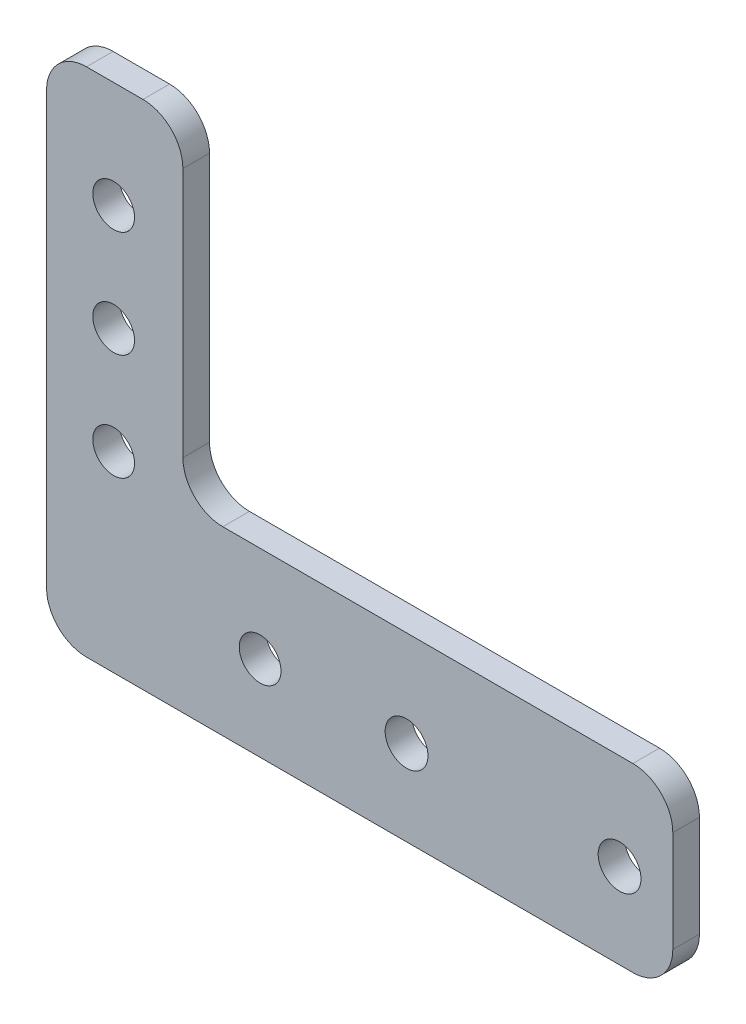
ISO-10303-21;
HEADER;
FILE_DESCRIPTION(('STEP AP214'),'2;1');
FILE_NAME('part.step','',(''),(''),'','','');
FILE_SCHEMA(('AUTOMOTIVE_DESIGN { 1 0 10303 214 1 1 1 1 }'));
ENDSEC;
DATA;
#1=APPLICATION_CONTEXT('core data for automotive mechanical design processes');
#2=APPLICATION_PROTOCOL_DEFINITION('international standard','automotive_design',2000,#1);
#3=PRODUCT_CONTEXT('',#1,'mechanical');
#4=PRODUCT('Part','Part','',(#3));
#5=PRODUCT_RELATED_PRODUCT_CATEGORY('part','',(#4));
#6=PRODUCT_DEFINITION_FORMATION('','',#4);
#7=PRODUCT_DEFINITION_CONTEXT('part definition',#1,'design');
#8=PRODUCT_DEFINITION('design','',#6,#7);
#9=PRODUCT_DEFINITION_SHAPE('','',#8);
#10=(LENGTH_UNIT() NAMED_UNIT(*) SI_UNIT(.MILLI.,.METRE.));
#11=(NAMED_UNIT(*) PLANE_ANGLE_UNIT() SI_UNIT($,.RADIAN.));
#12=(NAMED_UNIT(*) SI_UNIT($,.STERADIAN.) SOLID_ANGLE_UNIT());
#13=UNCERTAINTY_MEASURE_WITH_UNIT(LENGTH_MEASURE(1.E-05),#10,'distance_accuracy_value','');
#14=(GEOMETRIC_REPRESENTATION_CONTEXT(3) GLOBAL_UNCERTAINTY_ASSIGNED_CONTEXT((#13)) GLOBAL_UNIT_ASSIGNED_CONTEXT((#10,
#11,#12)) REPRESENTATION_CONTEXT('',''));
#15=CARTESIAN_POINT('',(0.,0.,0.));
#16=DIRECTION('',(0.,0.,1.));
#17=DIRECTION('',(1.,0.,0.));
#18=AXIS2_PLACEMENT_3D('',#15,#16,#17);
#19=CARTESIAN_POINT('',(-33.401,0.,3.175));
#20=DIRECTION('',(-1.,0.,0.));
#21=DIRECTION('',(0.,0.,1.));
#22=AXIS2_PLACEMENT_3D('',#19,#20,#21);
#23=PLANE('',#22);
#24=DIRECTION('',(0.,1.,0.));
#25=VECTOR('',#24,1.);
#26=CARTESIAN_POINT('',(-33.401,0.,3.175));
#27=LINE('',#26,#25);
#28=CARTESIAN_POINT('',(-33.401,-24.4475,3.175));
#29=VERTEX_POINT('',#28);
#30=CARTESIAN_POINT('',(-33.401,26.9875,3.175));
#31=VERTEX_POINT('',#30);
#32=EDGE_CURVE('E311',#29,#31,#27,.T.);
#33=ORIENTED_EDGE('',*,*,#32,.T.);
#34=DIRECTION('',(0.,0.,-1.));
#35=VECTOR('',#34,1.);
#36=CARTESIAN_POINT('',(-33.401,26.9875,3.175));
#37=LINE('',#36,#35);
#38=CARTESIAN_POINT('',(-33.401,26.9875,0.));
#39=VERTEX_POINT('',#38);
#40=EDGE_CURVE('E143',#31,#39,#37,.T.);
#41=ORIENTED_EDGE('',*,*,#40,.T.);
#42=DIRECTION('',(0.,1.,0.));
#43=VECTOR('',#42,1.);
#44=CARTESIAN_POINT('',(-33.401,0.,0.));
#45=LINE('',#44,#43);
#46=CARTESIAN_POINT('',(-33.401,-24.4475,0.));
#47=VERTEX_POINT('',#46);
#48=EDGE_CURVE('E134',#47,#39,#45,.T.);
#49=ORIENTED_EDGE('',*,*,#48,.F.);
#50=DIRECTION('',(0.,0.,-1.));
#51=VECTOR('',#50,1.);
#52=CARTESIAN_POINT('',(-33.401,-24.4475,3.175));
#53=LINE('',#52,#51);
#54=EDGE_CURVE('E148',#47,#29,#53,.F.);
#55=ORIENTED_EDGE('',*,*,#54,.T.);
#56=EDGE_LOOP('',(#33,#41,#49,#55));
#57=FACE_BOUND('',#56,.T.);
#58=ADVANCED_FACE('F41',(#57),#23,.T.);
#59=CARTESIAN_POINT('',(0.,-29.21,3.175));
#60=DIRECTION('',(0.,1.,0.));
#61=DIRECTION('',(0.,0.,1.));
#62=AXIS2_PLACEMENT_3D('',#59,#60,#61);
#63=PLANE('',#62);
#64=DIRECTION('',(1.,0.,0.));
#65=VECTOR('',#64,1.);
#66=CARTESIAN_POINT('',(0.,-29.21,0.));
#67=LINE('',#66,#65);
#68=CARTESIAN_POINT('',(-28.6385,-29.21,0.));
#69=VERTEX_POINT('',#68);
#70=CARTESIAN_POINT('',(36.5125,-29.21,0.));
#71=VERTEX_POINT('',#70);
#72=EDGE_CURVE('E136',#69,#71,#67,.T.);
#73=ORIENTED_EDGE('',*,*,#72,.T.);
#74=DIRECTION('',(0.,0.,-1.));
#75=VECTOR('',#74,1.);
#76=CARTESIAN_POINT('',(36.5125,-29.21,3.175));
#77=LINE('',#76,#75);
#78=CARTESIAN_POINT('',(36.5125,-29.21,3.175));
#79=VERTEX_POINT('',#78);
#80=EDGE_CURVE('E224',#71,#79,#77,.F.);
#81=ORIENTED_EDGE('',*,*,#80,.T.);
#82=DIRECTION('',(1.,0.,0.));
#83=VECTOR('',#82,1.);
#84=CARTESIAN_POINT('',(0.,-29.21,3.175));
#85=LINE('',#84,#83);
#86=CARTESIAN_POINT('',(-28.6385,-29.21,3.175));
#87=VERTEX_POINT('',#86);
#88=EDGE_CURVE('E314',#87,#79,#85,.T.);
#89=ORIENTED_EDGE('',*,*,#88,.F.);
#90=DIRECTION('',(0.,0.,-1.));
#91=VECTOR('',#90,1.);
#92=CARTESIAN_POINT('',(-28.6385,-29.21,0.));
#93=LINE('',#92,#91);
#94=EDGE_CURVE('E221',#87,#69,#93,.T.);
#95=ORIENTED_EDGE('',*,*,#94,.T.);
#96=EDGE_LOOP('',(#73,#81,#89,#95));
#97=FACE_BOUND('',#96,.T.);
#98=ADVANCED_FACE('F335',(#97),#63,.F.);
#99=CARTESIAN_POINT('',(41.275,0.,3.175));
#100=DIRECTION('',(-1.,0.,0.));
#101=DIRECTION('',(0.,0.,1.));
#102=AXIS2_PLACEMENT_3D('',#99,#100,#101);
#103=PLANE('',#102);
#104=DIRECTION('',(0.,1.,0.));
#105=VECTOR('',#104,1.);
#106=CARTESIAN_POINT('',(41.275,0.,0.));
#107=LINE('',#106,#105);
#108=CARTESIAN_POINT('',(41.275,-24.4475,0.));
#109=VERTEX_POINT('',#108);
#110=CARTESIAN_POINT('',(41.275,-12.3825,0.));
#111=VERTEX_POINT('',#110);
#112=EDGE_CURVE('E240',#109,#111,#107,.T.);
#113=ORIENTED_EDGE('',*,*,#112,.T.);
#114=DIRECTION('',(0.,0.,-1.));
#115=VECTOR('',#114,1.);
#116=CARTESIAN_POINT('',(41.275,-12.3825,3.175));
#117=LINE('',#116,#115);
#118=CARTESIAN_POINT('',(41.275,-12.3825,3.175));
#119=VERTEX_POINT('',#118);
#120=EDGE_CURVE('E218',#111,#119,#117,.F.);
#121=ORIENTED_EDGE('',*,*,#120,.T.);
#122=DIRECTION('',(0.,1.,0.));
#123=VECTOR('',#122,1.);
#124=CARTESIAN_POINT('',(41.275,0.,3.175));
#125=LINE('',#124,#123);
#126=CARTESIAN_POINT('',(41.275,-24.4475,3.175));
#127=VERTEX_POINT('',#126);
#128=EDGE_CURVE('E249',#127,#119,#125,.T.);
#129=ORIENTED_EDGE('',*,*,#128,.F.);
#130=DIRECTION('',(0.,0.,-1.));
#131=VECTOR('',#130,1.);
#132=CARTESIAN_POINT('',(41.275,-24.4475,3.175));
#133=LINE('',#132,#131);
#134=EDGE_CURVE('E214',#127,#109,#133,.T.);
#135=ORIENTED_EDGE('',*,*,#134,.T.);
#136=EDGE_LOOP('',(#113,#121,#129,#135));
#137=FACE_BOUND('',#136,.T.);
#138=ADVANCED_FACE('F330',(#137),#103,.F.);
#139=CARTESIAN_POINT('',(0.,-7.62000000000001,3.175));
#140=DIRECTION('',(0.,-1.,0.));
#141=DIRECTION('',(1.,0.,0.));
#142=AXIS2_PLACEMENT_3D('',#139,#140,#141);
#143=PLANE('',#142);
#144=DIRECTION('',(-1.,0.,0.));
#145=VECTOR('',#144,1.);
#146=CARTESIAN_POINT('',(0.,-7.62000000000001,0.));
#147=LINE('',#146,#145);
#148=CARTESIAN_POINT('',(36.5125,-7.62,0.));
#149=VERTEX_POINT('',#148);
#150=CARTESIAN_POINT('',(-12.3825,-7.62000000000001,0.));
#151=VERTEX_POINT('',#150);
#152=EDGE_CURVE('E230',#149,#151,#147,.T.);
#153=ORIENTED_EDGE('',*,*,#152,.T.);
#154=DIRECTION('',(0.,0.,-1.));
#155=VECTOR('',#154,1.);
#156=CARTESIAN_POINT('',(-12.3825,-7.62000000000001,3.175));
#157=LINE('',#156,#155);
#158=CARTESIAN_POINT('',(-12.3825,-7.62000000000001,3.175));
#159=VERTEX_POINT('',#158);
#160=EDGE_CURVE('E211',#151,#159,#157,.F.);
#161=ORIENTED_EDGE('',*,*,#160,.T.);
#162=DIRECTION('',(-1.,0.,0.));
#163=VECTOR('',#162,1.);
#164=CARTESIAN_POINT('',(0.,-7.62000000000001,3.175));
#165=LINE('',#164,#163);
#166=CARTESIAN_POINT('',(36.5125,-7.62,3.175));
#167=VERTEX_POINT('',#166);
#168=EDGE_CURVE('E246',#167,#159,#165,.T.);
#169=ORIENTED_EDGE('',*,*,#168,.F.);
#170=DIRECTION('',(0.,0.,-1.));
#171=VECTOR('',#170,1.);
#172=CARTESIAN_POINT('',(36.5125,-7.62,3.175));
#173=LINE('',#172,#171);
#174=EDGE_CURVE('E207',#167,#149,#173,.T.);
#175=ORIENTED_EDGE('',*,*,#174,.T.);
#176=EDGE_LOOP('',(#153,#161,#169,#175));
#177=FACE_BOUND('',#176,.T.);
#178=ADVANCED_FACE('F236',(#177),#143,.F.);
#179=CARTESIAN_POINT('',(-17.145,0.,3.175));
#180=DIRECTION('',(1.,0.,0.));
#181=DIRECTION('',(0.,1.,0.));
#182=AXIS2_PLACEMENT_3D('',#179,#180,#181);
#183=PLANE('',#182);
#184=DIRECTION('',(0.,-1.,0.));
#185=VECTOR('',#184,1.);
#186=CARTESIAN_POINT('',(-17.145,0.,0.));
#187=LINE('',#186,#185);
#188=CARTESIAN_POINT('',(-17.145,26.9875,0.));
#189=VERTEX_POINT('',#188);
#190=CARTESIAN_POINT('',(-17.145,-2.85750000000001,0.));
#191=VERTEX_POINT('',#190);
#192=EDGE_CURVE('E231',#189,#191,#187,.T.);
#193=ORIENTED_EDGE('',*,*,#192,.F.);
#194=DIRECTION('',(0.,0.,-1.));
#195=VECTOR('',#194,1.);
#196=CARTESIAN_POINT('',(-17.145,26.9875,3.175));
#197=LINE('',#196,#195);
#198=CARTESIAN_POINT('',(-17.145,26.9875,3.175));
#199=VERTEX_POINT('',#198);
#200=EDGE_CURVE('E62',#189,#199,#197,.F.);
#201=ORIENTED_EDGE('',*,*,#200,.T.);
#202=DIRECTION('',(0.,-1.,0.));
#203=VECTOR('',#202,1.);
#204=CARTESIAN_POINT('',(-17.145,0.,3.175));
#205=LINE('',#204,#203);
#206=CARTESIAN_POINT('',(-17.145,-2.85750000000001,3.175));
#207=VERTEX_POINT('',#206);
#208=EDGE_CURVE('E163',#199,#207,#205,.T.);
#209=ORIENTED_EDGE('',*,*,#208,.T.);
#210=DIRECTION('',(0.,0.,-1.));
#211=VECTOR('',#210,1.);
#212=CARTESIAN_POINT('',(-17.145,-2.85750000000001,3.175));
#213=LINE('',#212,#211);
#214=EDGE_CURVE('E201',#207,#191,#213,.T.);
#215=ORIENTED_EDGE('',*,*,#214,.T.);
#216=EDGE_LOOP('',(#193,#201,#209,#215));
#217=FACE_BOUND('',#216,.T.);
#218=ADVANCED_FACE('F243',(#217),#183,.T.);
#219=CARTESIAN_POINT('',(-25.4,-6.35,3.175));
#220=DIRECTION('',(0.,0.,-1.));
#221=DIRECTION('',(-1.,0.,0.));
#222=AXIS2_PLACEMENT_3D('',#219,#220,#221);
#223=CYLINDRICAL_SURFACE('',#222,2.4892);
#224=CARTESIAN_POINT('',(-25.4,-6.35,3.175));
#225=DIRECTION('',(0.,0.,1.));
#226=DIRECTION('',(1.,0.,0.));
#227=AXIS2_PLACEMENT_3D('',#224,#225,#226);
#228=CIRCLE('',#227,2.4892);
#229=CARTESIAN_POINT('',(-22.9108,-6.35,3.175));
#230=VERTEX_POINT('',#229);
#231=EDGE_CURVE('E307',#230,#230,#228,.T.);
#232=ORIENTED_EDGE('',*,*,#231,.T.);
#233=EDGE_LOOP('',(#232));
#234=FACE_BOUND('',#233,.T.);
#235=CARTESIAN_POINT('',(-25.4,-6.35,0.));
#236=DIRECTION('',(0.,0.,1.));
#237=DIRECTION('',(1.,0.,0.));
#238=AXIS2_PLACEMENT_3D('',#235,#236,#237);
#239=CIRCLE('',#238,2.4892);
#240=CARTESIAN_POINT('',(-22.9108,-6.35,0.));
#241=VERTEX_POINT('',#240);
#242=EDGE_CURVE('E152',#241,#241,#239,.T.);
#243=ORIENTED_EDGE('',*,*,#242,.F.);
#244=EDGE_LOOP('',(#243));
#245=FACE_BOUND('',#244,.T.);
#246=ADVANCED_FACE('F362',(#234,#245),#223,.F.);
#247=CARTESIAN_POINT('',(-25.4,6.35,3.175));
#248=DIRECTION('',(0.,0.,-1.));
#249=DIRECTION('',(-1.,0.,0.));
#250=AXIS2_PLACEMENT_3D('',#247,#248,#249);
#251=CYLINDRICAL_SURFACE('',#250,2.4892);
#252=CARTESIAN_POINT('',(-25.4,6.35,3.175));
#253=DIRECTION('',(0.,0.,1.));
#254=DIRECTION('',(1.,0.,0.));
#255=AXIS2_PLACEMENT_3D('',#252,#253,#254);
#256=CIRCLE('',#255,2.4892);
#257=CARTESIAN_POINT('',(-22.9108,6.35,3.175));
#258=VERTEX_POINT('',#257);
#259=EDGE_CURVE('E303',#258,#258,#256,.T.);
#260=ORIENTED_EDGE('',*,*,#259,.T.);
#261=EDGE_LOOP('',(#260));
#262=FACE_BOUND('',#261,.T.);
#263=CARTESIAN_POINT('',(-25.4,6.35,0.));
#264=DIRECTION('',(0.,0.,1.));
#265=DIRECTION('',(1.,0.,0.));
#266=AXIS2_PLACEMENT_3D('',#263,#264,#265);
#267=CIRCLE('',#266,2.4892);
#268=CARTESIAN_POINT('',(-22.9108,6.35,0.));
#269=VERTEX_POINT('',#268);
#270=EDGE_CURVE('E269',#269,#269,#267,.T.);
#271=ORIENTED_EDGE('',*,*,#270,.F.);
#272=EDGE_LOOP('',(#271));
#273=FACE_BOUND('',#272,.T.);
#274=ADVANCED_FACE('F365',(#262,#273),#251,.F.);
#275=CARTESIAN_POINT('',(-25.4,19.05,3.175));
#276=DIRECTION('',(0.,0.,-1.));
#277=DIRECTION('',(-1.,0.,0.));
#278=AXIS2_PLACEMENT_3D('',#275,#276,#277);
#279=CYLINDRICAL_SURFACE('',#278,2.4892);
#280=CARTESIAN_POINT('',(-25.4,19.05,3.175));
#281=DIRECTION('',(0.,0.,1.));
#282=DIRECTION('',(1.,0.,0.));
#283=AXIS2_PLACEMENT_3D('',#280,#281,#282);
#284=CIRCLE('',#283,2.4892);
#285=CARTESIAN_POINT('',(-22.9108,19.05,3.175));
#286=VERTEX_POINT('',#285);
#287=EDGE_CURVE('E299',#286,#286,#284,.T.);
#288=ORIENTED_EDGE('',*,*,#287,.T.);
#289=EDGE_LOOP('',(#288));
#290=FACE_BOUND('',#289,.T.);
#291=CARTESIAN_POINT('',(-25.4,19.05,0.));
#292=DIRECTION('',(0.,0.,1.));
#293=DIRECTION('',(1.,0.,0.));
#294=AXIS2_PLACEMENT_3D('',#291,#292,#293);
#295=CIRCLE('',#294,2.4892);
#296=CARTESIAN_POINT('',(-22.9108,19.05,0.));
#297=VERTEX_POINT('',#296);
#298=EDGE_CURVE('E265',#297,#297,#295,.T.);
#299=ORIENTED_EDGE('',*,*,#298,.F.);
#300=EDGE_LOOP('',(#299));
#301=FACE_BOUND('',#300,.T.);
#302=ADVANCED_FACE('F369',(#290,#301),#279,.F.);
#303=CARTESIAN_POINT('',(-7.9375,-19.05,3.175));
#304=DIRECTION('',(0.,0.,-1.));
#305=DIRECTION('',(-1.,0.,0.));
#306=AXIS2_PLACEMENT_3D('',#303,#304,#305);
#307=CYLINDRICAL_SURFACE('',#306,2.4892);
#308=CARTESIAN_POINT('',(-7.9375,-19.05,3.175));
#309=DIRECTION('',(0.,0.,1.));
#310=DIRECTION('',(1.,0.,0.));
#311=AXIS2_PLACEMENT_3D('',#308,#309,#310);
#312=CIRCLE('',#311,2.4892);
#313=CARTESIAN_POINT('',(-5.4483,-19.05,3.175));
#314=VERTEX_POINT('',#313);
#315=EDGE_CURVE('E293',#314,#314,#312,.T.);
#316=ORIENTED_EDGE('',*,*,#315,.T.);
#317=EDGE_LOOP('',(#316));
#318=FACE_BOUND('',#317,.T.);
#319=CARTESIAN_POINT('',(-7.9375,-19.05,0.));
#320=DIRECTION('',(0.,0.,1.));
#321=DIRECTION('',(1.,0.,0.));
#322=AXIS2_PLACEMENT_3D('',#319,#320,#321);
#323=CIRCLE('',#322,2.4892);
#324=CARTESIAN_POINT('',(-5.4483,-19.05,0.));
#325=VERTEX_POINT('',#324);
#326=EDGE_CURVE('E261',#325,#325,#323,.T.);
#327=ORIENTED_EDGE('',*,*,#326,.F.);
#328=EDGE_LOOP('',(#327));
#329=FACE_BOUND('',#328,.T.);
#330=ADVANCED_FACE('F373',(#318,#329),#307,.F.);
#331=CARTESIAN_POINT('',(9.525,-19.05,3.175));
#332=DIRECTION('',(0.,0.,-1.));
#333=DIRECTION('',(-1.,0.,0.));
#334=AXIS2_PLACEMENT_3D('',#331,#332,#333);
#335=CYLINDRICAL_SURFACE('',#334,2.5527);
#336=CARTESIAN_POINT('',(9.525,-19.05,3.175));
#337=DIRECTION('',(0.,0.,1.));
#338=DIRECTION('',(1.,0.,0.));
#339=AXIS2_PLACEMENT_3D('',#336,#337,#338);
#340=CIRCLE('',#339,2.5527);
#341=CARTESIAN_POINT('',(12.0777,-19.05,3.175));
#342=VERTEX_POINT('',#341);
#343=EDGE_CURVE('E287',#342,#342,#340,.T.);
#344=ORIENTED_EDGE('',*,*,#343,.T.);
#345=EDGE_LOOP('',(#344));
#346=FACE_BOUND('',#345,.T.);
#347=CARTESIAN_POINT('',(9.525,-19.05,0.));
#348=DIRECTION('',(0.,0.,1.));
#349=DIRECTION('',(1.,0.,0.));
#350=AXIS2_PLACEMENT_3D('',#347,#348,#349);
#351=CIRCLE('',#350,2.5527);
#352=CARTESIAN_POINT('',(12.0777,-19.05,0.));
#353=VERTEX_POINT('',#352);
#354=EDGE_CURVE('E257',#353,#353,#351,.T.);
#355=ORIENTED_EDGE('',*,*,#354,.F.);
#356=EDGE_LOOP('',(#355));
#357=FACE_BOUND('',#356,.T.);
#358=ADVANCED_FACE('F377',(#346,#357),#335,.F.);
#359=CARTESIAN_POINT('',(34.925,-19.05,3.175));
#360=DIRECTION('',(0.,0.,-1.));
#361=DIRECTION('',(-1.,0.,0.));
#362=AXIS2_PLACEMENT_3D('',#359,#360,#361);
#363=CYLINDRICAL_SURFACE('',#362,2.5527);
#364=CARTESIAN_POINT('',(34.925,-19.05,3.175));
#365=DIRECTION('',(0.,0.,1.));
#366=DIRECTION('',(1.,0.,0.));
#367=AXIS2_PLACEMENT_3D('',#364,#365,#366);
#368=CIRCLE('',#367,2.5527);
#369=CARTESIAN_POINT('',(37.4777,-19.05,3.175));
#370=VERTEX_POINT('',#369);
#371=EDGE_CURVE('E283',#370,#370,#368,.T.);
#372=ORIENTED_EDGE('',*,*,#371,.T.);
#373=EDGE_LOOP('',(#372));
#374=FACE_BOUND('',#373,.T.);
#375=CARTESIAN_POINT('',(34.925,-19.05,0.));
#376=DIRECTION('',(0.,0.,1.));
#377=DIRECTION('',(1.,0.,0.));
#378=AXIS2_PLACEMENT_3D('',#375,#376,#377);
#379=CIRCLE('',#378,2.5527);
#380=CARTESIAN_POINT('',(37.4777,-19.05,0.));
#381=VERTEX_POINT('',#380);
#382=EDGE_CURVE('E253',#381,#381,#379,.T.);
#383=ORIENTED_EDGE('',*,*,#382,.F.);
#384=EDGE_LOOP('',(#383));
#385=FACE_BOUND('',#384,.T.);
#386=ADVANCED_FACE('F381',(#374,#385),#363,.F.);
#387=CARTESIAN_POINT('',(0.,31.75,3.175));
#388=DIRECTION('',(0.,1.,0.));
#389=DIRECTION('',(-1.,0.,0.));
#390=AXIS2_PLACEMENT_3D('',#387,#388,#389);
#391=PLANE('',#390);
#392=DIRECTION('',(1.,0.,0.));
#393=VECTOR('',#392,1.);
#394=CARTESIAN_POINT('',(0.,31.75,0.));
#395=LINE('',#394,#393);
#396=CARTESIAN_POINT('',(-28.6385,31.75,0.));
#397=VERTEX_POINT('',#396);
#398=CARTESIAN_POINT('',(-21.9075,31.75,0.));
#399=VERTEX_POINT('',#398);
#400=EDGE_CURVE('E166',#397,#399,#395,.T.);
#401=ORIENTED_EDGE('',*,*,#400,.F.);
#402=DIRECTION('',(0.,0.,-1.));
#403=VECTOR('',#402,1.);
#404=CARTESIAN_POINT('',(-28.6385,31.75,3.175));
#405=LINE('',#404,#403);
#406=CARTESIAN_POINT('',(-28.6385,31.75,3.175));
#407=VERTEX_POINT('',#406);
#408=EDGE_CURVE('E184',#397,#407,#405,.F.);
#409=ORIENTED_EDGE('',*,*,#408,.T.);
#410=DIRECTION('',(1.,0.,0.));
#411=VECTOR('',#410,1.);
#412=CARTESIAN_POINT('',(0.,31.75,3.175));
#413=LINE('',#412,#411);
#414=CARTESIAN_POINT('',(-21.9075,31.75,3.175));
#415=VERTEX_POINT('',#414);
#416=EDGE_CURVE('E157',#407,#415,#413,.T.);
#417=ORIENTED_EDGE('',*,*,#416,.T.);
#418=DIRECTION('',(0.,0.,-1.));
#419=VECTOR('',#418,1.);
#420=CARTESIAN_POINT('',(-21.9075,31.75,3.175));
#421=LINE('',#420,#419);
#422=EDGE_CURVE('E180',#415,#399,#421,.T.);
#423=ORIENTED_EDGE('',*,*,#422,.T.);
#424=EDGE_LOOP('',(#401,#409,#417,#423));
#425=FACE_BOUND('',#424,.T.);
#426=ADVANCED_FACE('F342',(#425),#391,.T.);
#427=CARTESIAN_POINT('',(0.,0.,3.175));
#428=DIRECTION('',(0.,0.,1.));
#429=DIRECTION('',(1.,0.,0.));
#430=AXIS2_PLACEMENT_3D('',#427,#428,#429);
#431=PLANE('',#430);
#432=ORIENTED_EDGE('',*,*,#371,.F.);
#433=EDGE_LOOP('',(#432));
#434=FACE_BOUND('',#433,.T.);
#435=ORIENTED_EDGE('',*,*,#343,.F.);
#436=EDGE_LOOP('',(#435));
#437=FACE_BOUND('',#436,.T.);
#438=ORIENTED_EDGE('',*,*,#315,.F.);
#439=EDGE_LOOP('',(#438));
#440=FACE_BOUND('',#439,.T.);
#441=ORIENTED_EDGE('',*,*,#287,.F.);
#442=EDGE_LOOP('',(#441));
#443=FACE_BOUND('',#442,.T.);
#444=ORIENTED_EDGE('',*,*,#259,.F.);
#445=EDGE_LOOP('',(#444));
#446=FACE_BOUND('',#445,.T.);
#447=ORIENTED_EDGE('',*,*,#231,.F.);
#448=EDGE_LOOP('',(#447));
#449=FACE_BOUND('',#448,.T.);
#450=ORIENTED_EDGE('',*,*,#416,.F.);
#451=CARTESIAN_POINT('',(-28.6385,26.9875,3.175));
#452=DIRECTION('',(0.,0.,1.));
#453=DIRECTION('',(1.,0.,0.));
#454=AXIS2_PLACEMENT_3D('',#451,#452,#453);
#455=CIRCLE('',#454,4.7625);
#456=EDGE_CURVE('E198',#407,#31,#455,.T.);
#457=ORIENTED_EDGE('',*,*,#456,.T.);
#458=ORIENTED_EDGE('',*,*,#32,.F.);
#459=CARTESIAN_POINT('',(-28.6385,-24.4475,3.175));
#460=DIRECTION('',(0.,0.,1.));
#461=DIRECTION('',(1.,0.,0.));
#462=AXIS2_PLACEMENT_3D('',#459,#460,#461);
#463=CIRCLE('',#462,4.7625);
#464=EDGE_CURVE('E155',#29,#87,#463,.T.);
#465=ORIENTED_EDGE('',*,*,#464,.T.);
#466=ORIENTED_EDGE('',*,*,#88,.T.);
#467=CARTESIAN_POINT('',(36.5125,-24.4475,3.175));
#468=DIRECTION('',(0.,0.,1.));
#469=DIRECTION('',(1.,0.,0.));
#470=AXIS2_PLACEMENT_3D('',#467,#468,#469);
#471=CIRCLE('',#470,4.7625);
#472=EDGE_CURVE('E189',#79,#127,#471,.T.);
#473=ORIENTED_EDGE('',*,*,#472,.T.);
#474=ORIENTED_EDGE('',*,*,#128,.T.);
#475=CARTESIAN_POINT('',(36.5125,-12.3825,3.175));
#476=DIRECTION('',(0.,0.,1.));
#477=DIRECTION('',(1.,0.,0.));
#478=AXIS2_PLACEMENT_3D('',#475,#476,#477);
#479=CIRCLE('',#478,4.7625);
#480=EDGE_CURVE('E192',#119,#167,#479,.T.);
#481=ORIENTED_EDGE('',*,*,#480,.T.);
#482=ORIENTED_EDGE('',*,*,#168,.T.);
#483=CARTESIAN_POINT('',(-12.3825,-2.85750000000001,3.175));
#484=DIRECTION('',(0.,0.,1.));
#485=DIRECTION('',(1.,0.,0.));
#486=AXIS2_PLACEMENT_3D('',#483,#484,#485);
#487=CIRCLE('',#486,4.7625);
#488=EDGE_CURVE('E11',#159,#207,#487,.F.);
#489=ORIENTED_EDGE('',*,*,#488,.T.);
#490=ORIENTED_EDGE('',*,*,#208,.F.);
#491=CARTESIAN_POINT('',(-21.9075,26.9875,3.175));
#492=DIRECTION('',(0.,0.,1.));
#493=DIRECTION('',(1.,0.,0.));
#494=AXIS2_PLACEMENT_3D('',#491,#492,#493);
#495=CIRCLE('',#494,4.7625);
#496=EDGE_CURVE('E195',#199,#415,#495,.T.);
#497=ORIENTED_EDGE('',*,*,#496,.T.);
#498=EDGE_LOOP('',(#450,#457,#458,#465,#466,#473,#474,#481,#482,#489,#490,#497));
#499=FACE_BOUND('',#498,.T.);
#500=ADVANCED_FACE('F322',(#434,#437,#440,#443,#446,#449,#499),#431,.T.);
#501=CARTESIAN_POINT('',(0.,0.,0.));
#502=DIRECTION('',(0.,0.,1.));
#503=DIRECTION('',(1.,0.,0.));
#504=AXIS2_PLACEMENT_3D('',#501,#502,#503);
#505=PLANE('',#504);
#506=ORIENTED_EDGE('',*,*,#382,.T.);
#507=EDGE_LOOP('',(#506));
#508=FACE_BOUND('',#507,.T.);
#509=ORIENTED_EDGE('',*,*,#354,.T.);
#510=EDGE_LOOP('',(#509));
#511=FACE_BOUND('',#510,.T.);
#512=ORIENTED_EDGE('',*,*,#326,.T.);
#513=EDGE_LOOP('',(#512));
#514=FACE_BOUND('',#513,.T.);
#515=ORIENTED_EDGE('',*,*,#298,.T.);
#516=EDGE_LOOP('',(#515));
#517=FACE_BOUND('',#516,.T.);
#518=ORIENTED_EDGE('',*,*,#270,.T.);
#519=EDGE_LOOP('',(#518));
#520=FACE_BOUND('',#519,.T.);
#521=ORIENTED_EDGE('',*,*,#242,.T.);
#522=EDGE_LOOP('',(#521));
#523=FACE_BOUND('',#522,.T.);
#524=ORIENTED_EDGE('',*,*,#48,.T.);
#525=CARTESIAN_POINT('',(-28.6385,26.9875,0.));
#526=DIRECTION('',(0.,0.,1.));
#527=DIRECTION('',(1.,0.,0.));
#528=AXIS2_PLACEMENT_3D('',#525,#526,#527);
#529=CIRCLE('',#528,4.7625);
#530=EDGE_CURVE('E177',#39,#397,#529,.F.);
#531=ORIENTED_EDGE('',*,*,#530,.T.);
#532=ORIENTED_EDGE('',*,*,#400,.T.);
#533=CARTESIAN_POINT('',(-21.9075,26.9875,0.));
#534=DIRECTION('',(0.,0.,1.));
#535=DIRECTION('',(1.,0.,0.));
#536=AXIS2_PLACEMENT_3D('',#533,#534,#535);
#537=CIRCLE('',#536,4.7625);
#538=EDGE_CURVE('E174',#399,#189,#537,.F.);
#539=ORIENTED_EDGE('',*,*,#538,.T.);
#540=ORIENTED_EDGE('',*,*,#192,.T.);
#541=CARTESIAN_POINT('',(-12.3825,-2.85750000000001,0.));
#542=DIRECTION('',(0.,0.,1.));
#543=DIRECTION('',(1.,0.,0.));
#544=AXIS2_PLACEMENT_3D('',#541,#542,#543);
#545=CIRCLE('',#544,4.7625);
#546=EDGE_CURVE('E50',#191,#151,#545,.T.);
#547=ORIENTED_EDGE('',*,*,#546,.T.);
#548=ORIENTED_EDGE('',*,*,#152,.F.);
#549=CARTESIAN_POINT('',(36.5125,-12.3825,0.));
#550=DIRECTION('',(0.,0.,1.));
#551=DIRECTION('',(1.,0.,0.));
#552=AXIS2_PLACEMENT_3D('',#549,#550,#551);
#553=CIRCLE('',#552,4.7625);
#554=EDGE_CURVE('E171',#149,#111,#553,.F.);
#555=ORIENTED_EDGE('',*,*,#554,.T.);
#556=ORIENTED_EDGE('',*,*,#112,.F.);
#557=CARTESIAN_POINT('',(36.5125,-24.4475,0.));
#558=DIRECTION('',(0.,0.,1.));
#559=DIRECTION('',(1.,0.,0.));
#560=AXIS2_PLACEMENT_3D('',#557,#558,#559);
#561=CIRCLE('',#560,4.7625);
#562=EDGE_CURVE('E142',#109,#71,#561,.F.);
#563=ORIENTED_EDGE('',*,*,#562,.T.);
#564=ORIENTED_EDGE('',*,*,#72,.F.);
#565=CARTESIAN_POINT('',(-28.6385,-24.4475,0.));
#566=DIRECTION('',(0.,0.,1.));
#567=DIRECTION('',(1.,0.,0.));
#568=AXIS2_PLACEMENT_3D('',#565,#566,#567);
#569=CIRCLE('',#568,4.7625);
#570=EDGE_CURVE('E131',#69,#47,#569,.F.);
#571=ORIENTED_EDGE('',*,*,#570,.T.);
#572=EDGE_LOOP('',(#524,#531,#532,#539,#540,#547,#548,#555,#556,#563,#564,#571));
#573=FACE_BOUND('',#572,.T.);
#574=ADVANCED_FACE('F133',(#508,#511,#514,#517,#520,#523,#573),#505,.F.);
#575=CARTESIAN_POINT('',(-28.6385,26.9875,3.175));
#576=DIRECTION('',(0.,0.,-1.));
#577=DIRECTION('',(-1.,0.,0.));
#578=AXIS2_PLACEMENT_3D('',#575,#576,#577);
#579=CYLINDRICAL_SURFACE('',#578,4.7625);
#580=ORIENTED_EDGE('',*,*,#456,.F.);
#581=ORIENTED_EDGE('',*,*,#408,.F.);
#582=ORIENTED_EDGE('',*,*,#530,.F.);
#583=ORIENTED_EDGE('',*,*,#40,.F.);
#584=EDGE_LOOP('',(#580,#581,#582,#583));
#585=FACE_BOUND('',#584,.T.);
#586=ADVANCED_FACE('F339',(#585),#579,.T.);
#587=CARTESIAN_POINT('',(-21.9075,26.9875,3.175));
#588=DIRECTION('',(0.,0.,-1.));
#589=DIRECTION('',(-1.,0.,0.));
#590=AXIS2_PLACEMENT_3D('',#587,#588,#589);
#591=CYLINDRICAL_SURFACE('',#590,4.7625);
#592=ORIENTED_EDGE('',*,*,#496,.F.);
#593=ORIENTED_EDGE('',*,*,#200,.F.);
#594=ORIENTED_EDGE('',*,*,#538,.F.);
#595=ORIENTED_EDGE('',*,*,#422,.F.);
#596=EDGE_LOOP('',(#592,#593,#594,#595));
#597=FACE_BOUND('',#596,.T.);
#598=ADVANCED_FACE('F345',(#597),#591,.T.);
#599=CARTESIAN_POINT('',(-12.3825,-2.85750000000001,3.175));
#600=DIRECTION('',(0.,0.,-1.));
#601=DIRECTION('',(-1.,0.,0.));
#602=AXIS2_PLACEMENT_3D('',#599,#600,#601);
#603=CYLINDRICAL_SURFACE('',#602,4.7625);
#604=ORIENTED_EDGE('',*,*,#488,.F.);
#605=ORIENTED_EDGE('',*,*,#160,.F.);
#606=ORIENTED_EDGE('',*,*,#546,.F.);
#607=ORIENTED_EDGE('',*,*,#214,.F.);
#608=EDGE_LOOP('',(#604,#605,#606,#607));
#609=FACE_BOUND('',#608,.T.);
#610=ADVANCED_FACE('F242',(#609),#603,.F.);
#611=CARTESIAN_POINT('',(36.5125,-12.3825,3.175));
#612=DIRECTION('',(0.,0.,-1.));
#613=DIRECTION('',(-1.,0.,0.));
#614=AXIS2_PLACEMENT_3D('',#611,#612,#613);
#615=CYLINDRICAL_SURFACE('',#614,4.7625);
#616=ORIENTED_EDGE('',*,*,#480,.F.);
#617=ORIENTED_EDGE('',*,*,#120,.F.);
#618=ORIENTED_EDGE('',*,*,#554,.F.);
#619=ORIENTED_EDGE('',*,*,#174,.F.);
#620=EDGE_LOOP('',(#616,#617,#618,#619));
#621=FACE_BOUND('',#620,.T.);
#622=ADVANCED_FACE('F328',(#621),#615,.T.);
#623=CARTESIAN_POINT('',(36.5125,-24.4475,3.175));
#624=DIRECTION('',(0.,0.,-1.));
#625=DIRECTION('',(-1.,0.,0.));
#626=AXIS2_PLACEMENT_3D('',#623,#624,#625);
#627=CYLINDRICAL_SURFACE('',#626,4.7625);
#628=ORIENTED_EDGE('',*,*,#472,.F.);
#629=ORIENTED_EDGE('',*,*,#80,.F.);
#630=ORIENTED_EDGE('',*,*,#562,.F.);
#631=ORIENTED_EDGE('',*,*,#134,.F.);
#632=EDGE_LOOP('',(#628,#629,#630,#631));
#633=FACE_BOUND('',#632,.T.);
#634=ADVANCED_FACE('F332',(#633),#627,.T.);
#635=CARTESIAN_POINT('',(-28.6385,-24.4475,3.175));
#636=DIRECTION('',(0.,0.,1.));
#637=DIRECTION('',(1.,0.,0.));
#638=AXIS2_PLACEMENT_3D('',#635,#636,#637);
#639=CYLINDRICAL_SURFACE('',#638,4.7625);
#640=ORIENTED_EDGE('',*,*,#464,.F.);
#641=ORIENTED_EDGE('',*,*,#54,.F.);
#642=ORIENTED_EDGE('',*,*,#570,.F.);
#643=ORIENTED_EDGE('',*,*,#94,.F.);
#644=EDGE_LOOP('',(#640,#641,#642,#643));
#645=FACE_BOUND('',#644,.T.);
#646=ADVANCED_FACE('F43',(#645),#639,.T.);
#647=CLOSED_SHELL('',(#58,#98,#138,#178,#218,#246,#274,#302,#330,#358,#386,#426,#500,#574,#586,
#598,#610,#622,#634,#646));
#648=MANIFOLD_SOLID_BREP('B2',#647);
#649=ADVANCED_BREP_SHAPE_REPRESENTATION('',(#18,#648),#14);
#650=SHAPE_DEFINITION_REPRESENTATION(#9,#649);
ENDSEC;
END-ISO-10303-21;
